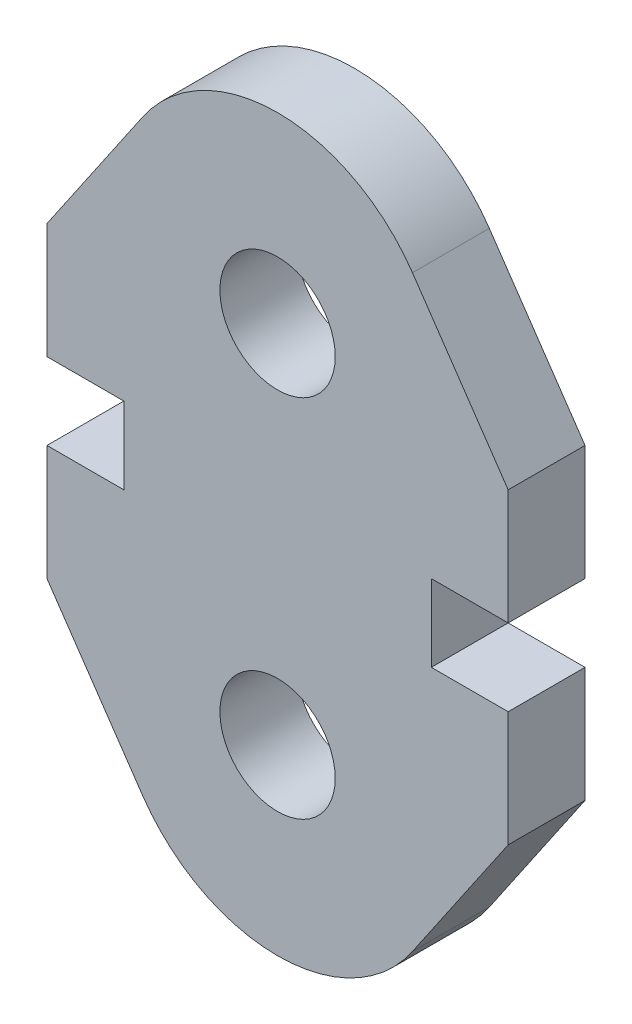
ISO-10303-21;
HEADER;
FILE_DESCRIPTION(('STEP AP214'),'2;1');
FILE_NAME('part.step','',(''),(''),'','','');
FILE_SCHEMA(('AUTOMOTIVE_DESIGN { 1 0 10303 214 1 1 1 1 }'));
ENDSEC;
DATA;
#1=APPLICATION_CONTEXT('core data for automotive mechanical design processes');
#2=APPLICATION_PROTOCOL_DEFINITION('international standard','automotive_design',2000,#1);
#3=PRODUCT_CONTEXT('',#1,'mechanical');
#4=PRODUCT('Part','Part','',(#3));
#5=PRODUCT_RELATED_PRODUCT_CATEGORY('part','',(#4));
#6=PRODUCT_DEFINITION_FORMATION('','',#4);
#7=PRODUCT_DEFINITION_CONTEXT('part definition',#1,'design');
#8=PRODUCT_DEFINITION('design','',#6,#7);
#9=PRODUCT_DEFINITION_SHAPE('','',#8);
#10=(LENGTH_UNIT() NAMED_UNIT(*) SI_UNIT(.MILLI.,.METRE.));
#11=(NAMED_UNIT(*) PLANE_ANGLE_UNIT() SI_UNIT($,.RADIAN.));
#12=(NAMED_UNIT(*) SI_UNIT($,.STERADIAN.) SOLID_ANGLE_UNIT());
#13=UNCERTAINTY_MEASURE_WITH_UNIT(LENGTH_MEASURE(1.E-05),#10,'distance_accuracy_value','');
#14=(GEOMETRIC_REPRESENTATION_CONTEXT(3) GLOBAL_UNCERTAINTY_ASSIGNED_CONTEXT((#13)) GLOBAL_UNIT_ASSIGNED_CONTEXT((#10,
#11,#12)) REPRESENTATION_CONTEXT('',''));
#15=CARTESIAN_POINT('',(0.,0.,0.));
#16=DIRECTION('',(0.,0.,1.));
#17=DIRECTION('',(1.,0.,0.));
#18=AXIS2_PLACEMENT_3D('',#15,#16,#17);
#19=CARTESIAN_POINT('',(0.,0.,1.));
#20=DIRECTION('',(0.,0.,1.));
#21=DIRECTION('',(1.,0.,0.));
#22=AXIS2_PLACEMENT_3D('',#19,#20,#21);
#23=PLANE('',#22);
#24=CARTESIAN_POINT('',(0.,5.75,1.));
#25=DIRECTION('',(0.,0.,1.));
#26=DIRECTION('',(1.,0.,0.));
#27=AXIS2_PLACEMENT_3D('',#24,#25,#26);
#28=CIRCLE('',#27,1.5);
#29=CARTESIAN_POINT('',(1.5,5.75,1.));
#30=VERTEX_POINT('',#29);
#31=EDGE_CURVE('E231',#30,#30,#28,.F.);
#32=ORIENTED_EDGE('',*,*,#31,.T.);
#33=EDGE_LOOP('',(#32));
#34=FACE_BOUND('',#33,.T.);
#35=DIRECTION('',(1.,0.,0.));
#36=VECTOR('',#35,1.);
#37=CARTESIAN_POINT('',(0.,0.,1.));
#38=LINE('',#37,#36);
#39=CARTESIAN_POINT('',(-4.,0.,1.));
#40=VERTEX_POINT('',#39);
#41=CARTESIAN_POINT('',(-6.,0.,1.));
#42=VERTEX_POINT('',#41);
#43=EDGE_CURVE('E161',#40,#42,#38,.F.);
#44=ORIENTED_EDGE('',*,*,#43,.T.);
#45=DIRECTION('',(0.,-1.,0.));
#46=VECTOR('',#45,1.);
#47=CARTESIAN_POINT('',(-6.,0.,1.));
#48=LINE('',#47,#46);
#49=CARTESIAN_POINT('',(-6.,-3.,1.));
#50=VERTEX_POINT('',#49);
#51=EDGE_CURVE('E159',#50,#42,#48,.F.);
#52=ORIENTED_EDGE('',*,*,#51,.F.);
#53=DIRECTION('',(0.563934312119362,-0.8258196483582,0.));
#54=VECTOR('',#53,1.);
#55=CARTESIAN_POINT('',(-5.48899265568138,-3.74831393714583,1.));
#56=LINE('',#55,#54);
#57=CARTESIAN_POINT('',(-3.50973350552235,-6.64672082650729,1.));
#58=VERTEX_POINT('',#57);
#59=EDGE_CURVE('E134',#58,#50,#56,.F.);
#60=ORIENTED_EDGE('',*,*,#59,.F.);
#61=CARTESIAN_POINT('',(0.,-4.25,1.));
#62=DIRECTION('',(0.,0.,1.));
#63=DIRECTION('',(1.,0.,0.));
#64=AXIS2_PLACEMENT_3D('',#61,#62,#63);
#65=CIRCLE('',#64,4.25);
#66=CARTESIAN_POINT('',(3.50973350552235,-6.64672082650729,1.));
#67=VERTEX_POINT('',#66);
#68=EDGE_CURVE('E127',#67,#58,#65,.F.);
#69=ORIENTED_EDGE('',*,*,#68,.F.);
#70=DIRECTION('',(-0.563934312119362,-0.8258196483582,0.));
#71=VECTOR('',#70,1.);
#72=CARTESIAN_POINT('',(5.48899265568138,-3.74831393714583,1.));
#73=LINE('',#72,#71);
#74=CARTESIAN_POINT('',(6.,-3.,1.));
#75=VERTEX_POINT('',#74);
#76=EDGE_CURVE('E131',#67,#75,#73,.F.);
#77=ORIENTED_EDGE('',*,*,#76,.T.);
#78=DIRECTION('',(0.,-1.,0.));
#79=VECTOR('',#78,1.);
#80=CARTESIAN_POINT('',(6.,0.,1.));
#81=LINE('',#80,#79);
#82=CARTESIAN_POINT('',(6.,0.,1.));
#83=VERTEX_POINT('',#82);
#84=EDGE_CURVE('E215',#75,#83,#81,.F.);
#85=ORIENTED_EDGE('',*,*,#84,.T.);
#86=DIRECTION('',(1.,0.,0.));
#87=VECTOR('',#86,1.);
#88=CARTESIAN_POINT('',(0.,0.,1.));
#89=LINE('',#88,#87);
#90=CARTESIAN_POINT('',(4.,0.,1.));
#91=VERTEX_POINT('',#90);
#92=EDGE_CURVE('E210',#83,#91,#89,.F.);
#93=ORIENTED_EDGE('',*,*,#92,.T.);
#94=DIRECTION('',(0.,-1.,0.));
#95=VECTOR('',#94,1.);
#96=CARTESIAN_POINT('',(4.,0.,1.));
#97=LINE('',#96,#95);
#98=CARTESIAN_POINT('',(4.,2.,1.));
#99=VERTEX_POINT('',#98);
#100=EDGE_CURVE('E205',#91,#99,#97,.F.);
#101=ORIENTED_EDGE('',*,*,#100,.T.);
#102=DIRECTION('',(1.,0.,0.));
#103=VECTOR('',#102,1.);
#104=CARTESIAN_POINT('',(0.,2.,1.));
#105=LINE('',#104,#103);
#106=CARTESIAN_POINT('',(6.,2.,1.));
#107=VERTEX_POINT('',#106);
#108=EDGE_CURVE('E197',#99,#107,#105,.T.);
#109=ORIENTED_EDGE('',*,*,#108,.T.);
#110=DIRECTION('',(0.,1.,0.));
#111=VECTOR('',#110,1.);
#112=CARTESIAN_POINT('',(6.,0.,1.));
#113=LINE('',#112,#111);
#114=CARTESIAN_POINT('',(6.,5.,1.));
#115=VERTEX_POINT('',#114);
#116=EDGE_CURVE('E195',#115,#107,#113,.F.);
#117=ORIENTED_EDGE('',*,*,#116,.F.);
#118=DIRECTION('',(-0.563934312119362,0.825819648358201,0.));
#119=VECTOR('',#118,1.);
#120=CARTESIAN_POINT('',(6.42040872634445,4.3843577539169,1.));
#121=LINE('',#120,#119);
#122=CARTESIAN_POINT('',(3.50973350552235,8.64672082650729,1.));
#123=VERTEX_POINT('',#122);
#124=EDGE_CURVE('E189',#123,#115,#121,.F.);
#125=ORIENTED_EDGE('',*,*,#124,.F.);
#126=CARTESIAN_POINT('',(0.,6.25,1.));
#127=DIRECTION('',(0.,0.,1.));
#128=DIRECTION('',(1.,0.,0.));
#129=AXIS2_PLACEMENT_3D('',#126,#127,#128);
#130=CIRCLE('',#129,4.25);
#131=CARTESIAN_POINT('',(-3.50973350552235,8.64672082650729,1.));
#132=VERTEX_POINT('',#131);
#133=EDGE_CURVE('E235',#132,#123,#130,.F.);
#134=ORIENTED_EDGE('',*,*,#133,.F.);
#135=DIRECTION('',(0.563934312119362,0.8258196483582,0.));
#136=VECTOR('',#135,1.);
#137=CARTESIAN_POINT('',(-6.42040872634445,4.3843577539169,1.));
#138=LINE('',#137,#136);
#139=CARTESIAN_POINT('',(-6.,5.,1.));
#140=VERTEX_POINT('',#139);
#141=EDGE_CURVE('E184',#132,#140,#138,.F.);
#142=ORIENTED_EDGE('',*,*,#141,.T.);
#143=DIRECTION('',(0.,1.,0.));
#144=VECTOR('',#143,1.);
#145=CARTESIAN_POINT('',(-6.,0.,1.));
#146=LINE('',#145,#144);
#147=CARTESIAN_POINT('',(-6.,2.,1.));
#148=VERTEX_POINT('',#147);
#149=EDGE_CURVE('E179',#140,#148,#146,.F.);
#150=ORIENTED_EDGE('',*,*,#149,.T.);
#151=DIRECTION('',(1.,0.,0.));
#152=VECTOR('',#151,1.);
#153=CARTESIAN_POINT('',(0.,2.,1.));
#154=LINE('',#153,#152);
#155=CARTESIAN_POINT('',(-4.,2.,1.));
#156=VERTEX_POINT('',#155);
#157=EDGE_CURVE('E171',#148,#156,#154,.T.);
#158=ORIENTED_EDGE('',*,*,#157,.T.);
#159=DIRECTION('',(0.,-1.,0.));
#160=VECTOR('',#159,1.);
#161=CARTESIAN_POINT('',(-4.,0.,1.));
#162=LINE('',#161,#160);
#163=EDGE_CURVE('E168',#40,#156,#162,.F.);
#164=ORIENTED_EDGE('',*,*,#163,.F.);
#165=EDGE_LOOP('',(#44,#52,#60,#69,#77,#85,#93,#101,#109,#117,#125,#134,#142,#150,#158,#164));
#166=FACE_BOUND('',#165,.T.);
#167=CARTESIAN_POINT('',(0.,-3.75,1.));
#168=DIRECTION('',(0.,0.,1.));
#169=DIRECTION('',(1.,0.,0.));
#170=AXIS2_PLACEMENT_3D('',#167,#168,#169);
#171=CIRCLE('',#170,1.5);
#172=CARTESIAN_POINT('',(1.5,-3.75,1.));
#173=VERTEX_POINT('',#172);
#174=EDGE_CURVE('E20',#173,#173,#171,.F.);
#175=ORIENTED_EDGE('',*,*,#174,.T.);
#176=EDGE_LOOP('',(#175));
#177=FACE_BOUND('',#176,.T.);
#178=ADVANCED_FACE('F17',(#34,#166,#177),#23,.T.);
#179=CARTESIAN_POINT('',(0.,-3.75,-1.));
#180=DIRECTION('',(0.,0.,1.));
#181=DIRECTION('',(1.,0.,0.));
#182=AXIS2_PLACEMENT_3D('',#179,#180,#181);
#183=CYLINDRICAL_SURFACE('',#182,1.5);
#184=CARTESIAN_POINT('',(0.,-3.75,-1.));
#185=DIRECTION('',(0.,0.,1.));
#186=DIRECTION('',(1.,0.,0.));
#187=AXIS2_PLACEMENT_3D('',#184,#185,#186);
#188=CIRCLE('',#187,1.5);
#189=CARTESIAN_POINT('',(1.5,-3.75,-1.));
#190=VERTEX_POINT('',#189);
#191=EDGE_CURVE('E228',#190,#190,#188,.F.);
#192=ORIENTED_EDGE('',*,*,#191,.T.);
#193=EDGE_LOOP('',(#192));
#194=FACE_BOUND('',#193,.T.);
#195=ORIENTED_EDGE('',*,*,#174,.F.);
#196=EDGE_LOOP('',(#195));
#197=FACE_BOUND('',#196,.T.);
#198=ADVANCED_FACE('F544',(#194,#197),#183,.F.);
#199=CARTESIAN_POINT('',(0.,-4.25,-1.));
#200=DIRECTION('',(0.,0.,1.));
#201=DIRECTION('',(1.,0.,0.));
#202=AXIS2_PLACEMENT_3D('',#199,#200,#201);
#203=CYLINDRICAL_SURFACE('',#202,4.25);
#204=CARTESIAN_POINT('',(0.,-4.25,-1.));
#205=DIRECTION('',(0.,0.,1.));
#206=DIRECTION('',(1.,0.,0.));
#207=AXIS2_PLACEMENT_3D('',#204,#205,#206);
#208=CIRCLE('',#207,4.25);
#209=CARTESIAN_POINT('',(-3.50973350552235,-6.64672082650729,-1.));
#210=VERTEX_POINT('',#209);
#211=CARTESIAN_POINT('',(3.50973350552235,-6.64672082650729,-1.));
#212=VERTEX_POINT('',#211);
#213=EDGE_CURVE('E149',#210,#212,#208,.T.);
#214=ORIENTED_EDGE('',*,*,#213,.T.);
#215=DIRECTION('',(0.,0.,1.));
#216=VECTOR('',#215,1.);
#217=CARTESIAN_POINT('',(3.50973350552235,-6.64672082650729,-1.));
#218=LINE('',#217,#216);
#219=EDGE_CURVE('E139',#212,#67,#218,.T.);
#220=ORIENTED_EDGE('',*,*,#219,.T.);
#221=ORIENTED_EDGE('',*,*,#68,.T.);
#222=DIRECTION('',(0.,0.,1.));
#223=VECTOR('',#222,1.);
#224=CARTESIAN_POINT('',(-3.50973350552235,-6.64672082650729,-1.));
#225=LINE('',#224,#223);
#226=EDGE_CURVE('E234',#210,#58,#225,.T.);
#227=ORIENTED_EDGE('',*,*,#226,.F.);
#228=EDGE_LOOP('',(#214,#220,#221,#227));
#229=FACE_BOUND('',#228,.T.);
#230=ADVANCED_FACE('F148',(#229),#203,.T.);
#231=CARTESIAN_POINT('',(5.48899265568138,-3.74831393714583,-1.));
#232=DIRECTION('',(-0.8258196483582,0.563934312119362,0.));
#233=DIRECTION('',(-0.563934312119362,-0.8258196483582,0.));
#234=AXIS2_PLACEMENT_3D('',#231,#232,#233);
#235=PLANE('',#234);
#236=ORIENTED_EDGE('',*,*,#219,.F.);
#237=DIRECTION('',(0.563934312119362,0.825819648358201,0.));
#238=VECTOR('',#237,1.);
#239=CARTESIAN_POINT('',(3.50973350552235,-6.64672082650729,-1.));
#240=LINE('',#239,#238);
#241=CARTESIAN_POINT('',(6.,-3.,-1.));
#242=VERTEX_POINT('',#241);
#243=EDGE_CURVE('E227',#212,#242,#240,.T.);
#244=ORIENTED_EDGE('',*,*,#243,.T.);
#245=DIRECTION('',(0.,0.,1.));
#246=VECTOR('',#245,1.);
#247=CARTESIAN_POINT('',(6.,-3.,-1.));
#248=LINE('',#247,#246);
#249=EDGE_CURVE('E145',#242,#75,#248,.T.);
#250=ORIENTED_EDGE('',*,*,#249,.T.);
#251=ORIENTED_EDGE('',*,*,#76,.F.);
#252=EDGE_LOOP('',(#236,#244,#250,#251));
#253=FACE_BOUND('',#252,.T.);
#254=ADVANCED_FACE('F142',(#253),#235,.F.);
#255=CARTESIAN_POINT('',(6.,0.,-1.));
#256=DIRECTION('',(-1.,0.,0.));
#257=DIRECTION('',(0.,-1.,0.));
#258=AXIS2_PLACEMENT_3D('',#255,#256,#257);
#259=PLANE('',#258);
#260=ORIENTED_EDGE('',*,*,#249,.F.);
#261=DIRECTION('',(0.,1.,0.));
#262=VECTOR('',#261,1.);
#263=CARTESIAN_POINT('',(6.,0.,-1.));
#264=LINE('',#263,#262);
#265=CARTESIAN_POINT('',(6.,0.,-1.));
#266=VERTEX_POINT('',#265);
#267=EDGE_CURVE('E279',#242,#266,#264,.T.);
#268=ORIENTED_EDGE('',*,*,#267,.T.);
#269=DIRECTION('',(0.,0.,1.));
#270=VECTOR('',#269,1.);
#271=CARTESIAN_POINT('',(6.,0.,-1.));
#272=LINE('',#271,#270);
#273=EDGE_CURVE('E212',#266,#83,#272,.T.);
#274=ORIENTED_EDGE('',*,*,#273,.T.);
#275=ORIENTED_EDGE('',*,*,#84,.F.);
#276=EDGE_LOOP('',(#260,#268,#274,#275));
#277=FACE_BOUND('',#276,.T.);
#278=ADVANCED_FACE('F519',(#277),#259,.F.);
#279=CARTESIAN_POINT('',(0.,0.,-1.));
#280=DIRECTION('',(0.,-1.,0.));
#281=DIRECTION('',(1.,0.,0.));
#282=AXIS2_PLACEMENT_3D('',#279,#280,#281);
#283=PLANE('',#282);
#284=ORIENTED_EDGE('',*,*,#273,.F.);
#285=DIRECTION('',(1.,0.,0.));
#286=VECTOR('',#285,1.);
#287=CARTESIAN_POINT('',(0.,0.,-1.));
#288=LINE('',#287,#286);
#289=CARTESIAN_POINT('',(4.,0.,-1.));
#290=VERTEX_POINT('',#289);
#291=EDGE_CURVE('E270',#266,#290,#288,.F.);
#292=ORIENTED_EDGE('',*,*,#291,.T.);
#293=DIRECTION('',(0.,0.,1.));
#294=VECTOR('',#293,1.);
#295=CARTESIAN_POINT('',(4.,0.,-1.));
#296=LINE('',#295,#294);
#297=EDGE_CURVE('E207',#290,#91,#296,.T.);
#298=ORIENTED_EDGE('',*,*,#297,.T.);
#299=ORIENTED_EDGE('',*,*,#92,.F.);
#300=EDGE_LOOP('',(#284,#292,#298,#299));
#301=FACE_BOUND('',#300,.T.);
#302=ADVANCED_FACE('F381',(#301),#283,.F.);
#303=CARTESIAN_POINT('',(4.,0.,-1.));
#304=DIRECTION('',(-1.,0.,0.));
#305=DIRECTION('',(0.,-1.,0.));
#306=AXIS2_PLACEMENT_3D('',#303,#304,#305);
#307=PLANE('',#306);
#308=ORIENTED_EDGE('',*,*,#297,.F.);
#309=DIRECTION('',(0.,1.,0.));
#310=VECTOR('',#309,1.);
#311=CARTESIAN_POINT('',(4.,0.,-1.));
#312=LINE('',#311,#310);
#313=CARTESIAN_POINT('',(4.,2.,-1.));
#314=VERTEX_POINT('',#313);
#315=EDGE_CURVE('E261',#290,#314,#312,.T.);
#316=ORIENTED_EDGE('',*,*,#315,.T.);
#317=DIRECTION('',(0.,0.,1.));
#318=VECTOR('',#317,1.);
#319=CARTESIAN_POINT('',(4.,2.,-1.));
#320=LINE('',#319,#318);
#321=EDGE_CURVE('E202',#314,#99,#320,.T.);
#322=ORIENTED_EDGE('',*,*,#321,.T.);
#323=ORIENTED_EDGE('',*,*,#100,.F.);
#324=EDGE_LOOP('',(#308,#316,#322,#323));
#325=FACE_BOUND('',#324,.T.);
#326=ADVANCED_FACE('F377',(#325),#307,.F.);
#327=CARTESIAN_POINT('',(0.,2.,-1.));
#328=DIRECTION('',(0.,1.,0.));
#329=DIRECTION('',(0.,0.,1.));
#330=AXIS2_PLACEMENT_3D('',#327,#328,#329);
#331=PLANE('',#330);
#332=ORIENTED_EDGE('',*,*,#321,.F.);
#333=DIRECTION('',(1.,0.,0.));
#334=VECTOR('',#333,1.);
#335=CARTESIAN_POINT('',(0.,2.,-1.));
#336=LINE('',#335,#334);
#337=CARTESIAN_POINT('',(6.,2.,-1.));
#338=VERTEX_POINT('',#337);
#339=EDGE_CURVE('E253',#314,#338,#336,.T.);
#340=ORIENTED_EDGE('',*,*,#339,.T.);
#341=DIRECTION('',(0.,0.,1.));
#342=VECTOR('',#341,1.);
#343=CARTESIAN_POINT('',(6.,2.,-1.));
#344=LINE('',#343,#342);
#345=EDGE_CURVE('E192',#107,#338,#344,.F.);
#346=ORIENTED_EDGE('',*,*,#345,.F.);
#347=ORIENTED_EDGE('',*,*,#108,.F.);
#348=EDGE_LOOP('',(#332,#340,#346,#347));
#349=FACE_BOUND('',#348,.T.);
#350=ADVANCED_FACE('F373',(#349),#331,.F.);
#351=CARTESIAN_POINT('',(6.,0.,-1.));
#352=DIRECTION('',(1.,0.,0.));
#353=DIRECTION('',(0.,1.,0.));
#354=AXIS2_PLACEMENT_3D('',#351,#352,#353);
#355=PLANE('',#354);
#356=DIRECTION('',(0.,1.,0.));
#357=VECTOR('',#356,1.);
#358=CARTESIAN_POINT('',(6.,0.,-1.));
#359=LINE('',#358,#357);
#360=CARTESIAN_POINT('',(6.,5.,-1.));
#361=VERTEX_POINT('',#360);
#362=EDGE_CURVE('E250',#338,#361,#359,.T.);
#363=ORIENTED_EDGE('',*,*,#362,.T.);
#364=DIRECTION('',(0.,0.,1.));
#365=VECTOR('',#364,1.);
#366=CARTESIAN_POINT('',(6.,5.,-1.));
#367=LINE('',#366,#365);
#368=EDGE_CURVE('E191',#115,#361,#367,.F.);
#369=ORIENTED_EDGE('',*,*,#368,.F.);
#370=ORIENTED_EDGE('',*,*,#116,.T.);
#371=ORIENTED_EDGE('',*,*,#345,.T.);
#372=EDGE_LOOP('',(#363,#369,#370,#371));
#373=FACE_BOUND('',#372,.T.);
#374=ADVANCED_FACE('F368',(#373),#355,.T.);
#375=CARTESIAN_POINT('',(6.42040872634445,4.3843577539169,-1.));
#376=DIRECTION('',(0.825819648358201,0.563934312119362,0.));
#377=DIRECTION('',(-0.563934312119362,0.825819648358201,0.));
#378=AXIS2_PLACEMENT_3D('',#375,#376,#377);
#379=PLANE('',#378);
#380=DIRECTION('',(-0.563934312119362,0.825819648358201,0.));
#381=VECTOR('',#380,1.);
#382=CARTESIAN_POINT('',(6.,5.,-1.));
#383=LINE('',#382,#381);
#384=CARTESIAN_POINT('',(3.50973350552235,8.64672082650729,-1.));
#385=VERTEX_POINT('',#384);
#386=EDGE_CURVE('E225',#361,#385,#383,.T.);
#387=ORIENTED_EDGE('',*,*,#386,.T.);
#388=DIRECTION('',(0.,0.,1.));
#389=VECTOR('',#388,1.);
#390=CARTESIAN_POINT('',(3.50973350552235,8.64672082650729,-1.));
#391=LINE('',#390,#389);
#392=EDGE_CURVE('E236',#123,#385,#391,.F.);
#393=ORIENTED_EDGE('',*,*,#392,.F.);
#394=ORIENTED_EDGE('',*,*,#124,.T.);
#395=ORIENTED_EDGE('',*,*,#368,.T.);
#396=EDGE_LOOP('',(#387,#393,#394,#395));
#397=FACE_BOUND('',#396,.T.);
#398=ADVANCED_FACE('F364',(#397),#379,.T.);
#399=CARTESIAN_POINT('',(0.,6.25,-1.));
#400=DIRECTION('',(0.,0.,1.));
#401=DIRECTION('',(1.,0.,0.));
#402=AXIS2_PLACEMENT_3D('',#399,#400,#401);
#403=CYLINDRICAL_SURFACE('',#402,4.25);
#404=CARTESIAN_POINT('',(0.,6.25,-1.));
#405=DIRECTION('',(0.,0.,1.));
#406=DIRECTION('',(1.,0.,0.));
#407=AXIS2_PLACEMENT_3D('',#404,#405,#406);
#408=CIRCLE('',#407,4.25);
#409=CARTESIAN_POINT('',(-3.50973350552235,8.64672082650729,-1.));
#410=VERTEX_POINT('',#409);
#411=EDGE_CURVE('E221',#385,#410,#408,.T.);
#412=ORIENTED_EDGE('',*,*,#411,.T.);
#413=DIRECTION('',(0.,0.,1.));
#414=VECTOR('',#413,1.);
#415=CARTESIAN_POINT('',(-3.50973350552235,8.64672082650729,-1.));
#416=LINE('',#415,#414);
#417=EDGE_CURVE('E186',#410,#132,#416,.T.);
#418=ORIENTED_EDGE('',*,*,#417,.T.);
#419=ORIENTED_EDGE('',*,*,#133,.T.);
#420=ORIENTED_EDGE('',*,*,#392,.T.);
#421=EDGE_LOOP('',(#412,#418,#419,#420));
#422=FACE_BOUND('',#421,.T.);
#423=ADVANCED_FACE('F344',(#422),#403,.T.);
#424=CARTESIAN_POINT('',(-6.42040872634445,4.3843577539169,-1.));
#425=DIRECTION('',(0.8258196483582,-0.563934312119362,0.));
#426=DIRECTION('',(0.563934312119362,0.8258196483582,0.));
#427=AXIS2_PLACEMENT_3D('',#424,#425,#426);
#428=PLANE('',#427);
#429=ORIENTED_EDGE('',*,*,#417,.F.);
#430=DIRECTION('',(-0.563934312119362,-0.825819648358201,0.));
#431=VECTOR('',#430,1.);
#432=CARTESIAN_POINT('',(-3.50973350552235,8.64672082650729,-1.));
#433=LINE('',#432,#431);
#434=CARTESIAN_POINT('',(-6.,5.,-1.));
#435=VERTEX_POINT('',#434);
#436=EDGE_CURVE('E224',#410,#435,#433,.T.);
#437=ORIENTED_EDGE('',*,*,#436,.T.);
#438=DIRECTION('',(0.,0.,1.));
#439=VECTOR('',#438,1.);
#440=CARTESIAN_POINT('',(-6.,5.,-1.));
#441=LINE('',#440,#439);
#442=EDGE_CURVE('E181',#435,#140,#441,.T.);
#443=ORIENTED_EDGE('',*,*,#442,.T.);
#444=ORIENTED_EDGE('',*,*,#141,.F.);
#445=EDGE_LOOP('',(#429,#437,#443,#444));
#446=FACE_BOUND('',#445,.T.);
#447=ADVANCED_FACE('F350',(#446),#428,.F.);
#448=CARTESIAN_POINT('',(-6.,0.,-1.));
#449=DIRECTION('',(1.,0.,0.));
#450=DIRECTION('',(0.,1.,0.));
#451=AXIS2_PLACEMENT_3D('',#448,#449,#450);
#452=PLANE('',#451);
#453=ORIENTED_EDGE('',*,*,#442,.F.);
#454=DIRECTION('',(0.,1.,0.));
#455=VECTOR('',#454,1.);
#456=CARTESIAN_POINT('',(-6.,0.,-1.));
#457=LINE('',#456,#455);
#458=CARTESIAN_POINT('',(-6.,2.,-1.));
#459=VERTEX_POINT('',#458);
#460=EDGE_CURVE('E330',#435,#459,#457,.F.);
#461=ORIENTED_EDGE('',*,*,#460,.T.);
#462=DIRECTION('',(0.,0.,1.));
#463=VECTOR('',#462,1.);
#464=CARTESIAN_POINT('',(-6.,2.,-1.));
#465=LINE('',#464,#463);
#466=EDGE_CURVE('E176',#459,#148,#465,.T.);
#467=ORIENTED_EDGE('',*,*,#466,.T.);
#468=ORIENTED_EDGE('',*,*,#149,.F.);
#469=EDGE_LOOP('',(#453,#461,#467,#468));
#470=FACE_BOUND('',#469,.T.);
#471=ADVANCED_FACE('F452',(#470),#452,.F.);
#472=CARTESIAN_POINT('',(0.,2.,-1.));
#473=DIRECTION('',(0.,1.,0.));
#474=DIRECTION('',(0.,0.,1.));
#475=AXIS2_PLACEMENT_3D('',#472,#473,#474);
#476=PLANE('',#475);
#477=ORIENTED_EDGE('',*,*,#466,.F.);
#478=DIRECTION('',(1.,0.,0.));
#479=VECTOR('',#478,1.);
#480=CARTESIAN_POINT('',(0.,2.,-1.));
#481=LINE('',#480,#479);
#482=CARTESIAN_POINT('',(-4.,2.,-1.));
#483=VERTEX_POINT('',#482);
#484=EDGE_CURVE('E322',#459,#483,#481,.T.);
#485=ORIENTED_EDGE('',*,*,#484,.T.);
#486=DIRECTION('',(0.,0.,1.));
#487=VECTOR('',#486,1.);
#488=CARTESIAN_POINT('',(-4.,2.,-1.));
#489=LINE('',#488,#487);
#490=EDGE_CURVE('E170',#156,#483,#489,.F.);
#491=ORIENTED_EDGE('',*,*,#490,.F.);
#492=ORIENTED_EDGE('',*,*,#157,.F.);
#493=EDGE_LOOP('',(#477,#485,#491,#492));
#494=FACE_BOUND('',#493,.T.);
#495=ADVANCED_FACE('F442',(#494),#476,.F.);
#496=CARTESIAN_POINT('',(-4.,0.,-1.));
#497=DIRECTION('',(-1.,0.,0.));
#498=DIRECTION('',(0.,-1.,0.));
#499=AXIS2_PLACEMENT_3D('',#496,#497,#498);
#500=PLANE('',#499);
#501=DIRECTION('',(0.,1.,0.));
#502=VECTOR('',#501,1.);
#503=CARTESIAN_POINT('',(-4.,0.,-1.));
#504=LINE('',#503,#502);
#505=CARTESIAN_POINT('',(-4.,0.,-1.));
#506=VERTEX_POINT('',#505);
#507=EDGE_CURVE('E313',#483,#506,#504,.F.);
#508=ORIENTED_EDGE('',*,*,#507,.T.);
#509=DIRECTION('',(0.,0.,1.));
#510=VECTOR('',#509,1.);
#511=CARTESIAN_POINT('',(-4.,0.,-1.));
#512=LINE('',#511,#510);
#513=EDGE_CURVE('E165',#506,#40,#512,.T.);
#514=ORIENTED_EDGE('',*,*,#513,.T.);
#515=ORIENTED_EDGE('',*,*,#163,.T.);
#516=ORIENTED_EDGE('',*,*,#490,.T.);
#517=EDGE_LOOP('',(#508,#514,#515,#516));
#518=FACE_BOUND('',#517,.T.);
#519=ADVANCED_FACE('F432',(#518),#500,.T.);
#520=CARTESIAN_POINT('',(0.,0.,-1.));
#521=DIRECTION('',(0.,-1.,0.));
#522=DIRECTION('',(1.,0.,0.));
#523=AXIS2_PLACEMENT_3D('',#520,#521,#522);
#524=PLANE('',#523);
#525=ORIENTED_EDGE('',*,*,#513,.F.);
#526=DIRECTION('',(1.,0.,0.));
#527=VECTOR('',#526,1.);
#528=CARTESIAN_POINT('',(0.,0.,-1.));
#529=LINE('',#528,#527);
#530=CARTESIAN_POINT('',(-6.,0.,-1.));
#531=VERTEX_POINT('',#530);
#532=EDGE_CURVE('E305',#506,#531,#529,.F.);
#533=ORIENTED_EDGE('',*,*,#532,.T.);
#534=DIRECTION('',(0.,0.,1.));
#535=VECTOR('',#534,1.);
#536=CARTESIAN_POINT('',(-6.,0.,-1.));
#537=LINE('',#536,#535);
#538=EDGE_CURVE('E156',#42,#531,#537,.F.);
#539=ORIENTED_EDGE('',*,*,#538,.F.);
#540=ORIENTED_EDGE('',*,*,#43,.F.);
#541=EDGE_LOOP('',(#525,#533,#539,#540));
#542=FACE_BOUND('',#541,.T.);
#543=ADVANCED_FACE('F394',(#542),#524,.F.);
#544=CARTESIAN_POINT('',(-6.,0.,-1.));
#545=DIRECTION('',(-1.,0.,0.));
#546=DIRECTION('',(0.,-1.,0.));
#547=AXIS2_PLACEMENT_3D('',#544,#545,#546);
#548=PLANE('',#547);
#549=DIRECTION('',(0.,1.,0.));
#550=VECTOR('',#549,1.);
#551=CARTESIAN_POINT('',(-6.,0.,-1.));
#552=LINE('',#551,#550);
#553=CARTESIAN_POINT('',(-6.,-3.,-1.));
#554=VERTEX_POINT('',#553);
#555=EDGE_CURVE('E302',#531,#554,#552,.F.);
#556=ORIENTED_EDGE('',*,*,#555,.T.);
#557=DIRECTION('',(0.,0.,1.));
#558=VECTOR('',#557,1.);
#559=CARTESIAN_POINT('',(-6.,-3.,-1.));
#560=LINE('',#559,#558);
#561=EDGE_CURVE('E35',#50,#554,#560,.F.);
#562=ORIENTED_EDGE('',*,*,#561,.F.);
#563=ORIENTED_EDGE('',*,*,#51,.T.);
#564=ORIENTED_EDGE('',*,*,#538,.T.);
#565=EDGE_LOOP('',(#556,#562,#563,#564));
#566=FACE_BOUND('',#565,.T.);
#567=ADVANCED_FACE('F385',(#566),#548,.T.);
#568=CARTESIAN_POINT('',(-5.48899265568138,-3.74831393714583,-1.));
#569=DIRECTION('',(-0.8258196483582,-0.563934312119362,0.));
#570=DIRECTION('',(0.563934312119362,-0.8258196483582,0.));
#571=AXIS2_PLACEMENT_3D('',#568,#569,#570);
#572=PLANE('',#571);
#573=DIRECTION('',(0.563934312119362,-0.825819648358201,0.));
#574=VECTOR('',#573,1.);
#575=CARTESIAN_POINT('',(-6.,-3.,-1.));
#576=LINE('',#575,#574);
#577=EDGE_CURVE('E26',#554,#210,#576,.T.);
#578=ORIENTED_EDGE('',*,*,#577,.T.);
#579=ORIENTED_EDGE('',*,*,#226,.T.);
#580=ORIENTED_EDGE('',*,*,#59,.T.);
#581=ORIENTED_EDGE('',*,*,#561,.T.);
#582=EDGE_LOOP('',(#578,#579,#580,#581));
#583=FACE_BOUND('',#582,.T.);
#584=ADVANCED_FACE('F382',(#583),#572,.T.);
#585=CARTESIAN_POINT('',(0.,5.75,-1.));
#586=DIRECTION('',(0.,0.,1.));
#587=DIRECTION('',(1.,0.,0.));
#588=AXIS2_PLACEMENT_3D('',#585,#586,#587);
#589=CYLINDRICAL_SURFACE('',#588,1.5);
#590=ORIENTED_EDGE('',*,*,#31,.F.);
#591=EDGE_LOOP('',(#590));
#592=FACE_BOUND('',#591,.T.);
#593=CARTESIAN_POINT('',(0.,5.75,-1.));
#594=DIRECTION('',(0.,0.,1.));
#595=DIRECTION('',(1.,0.,0.));
#596=AXIS2_PLACEMENT_3D('',#593,#594,#595);
#597=CIRCLE('',#596,1.5);
#598=CARTESIAN_POINT('',(1.5,5.75,-1.));
#599=VERTEX_POINT('',#598);
#600=EDGE_CURVE('E11',#599,#599,#597,.F.);
#601=ORIENTED_EDGE('',*,*,#600,.T.);
#602=EDGE_LOOP('',(#601));
#603=FACE_BOUND('',#602,.T.);
#604=ADVANCED_FACE('F384',(#592,#603),#589,.F.);
#605=CARTESIAN_POINT('',(0.,0.,-1.));
#606=DIRECTION('',(0.,0.,1.));
#607=DIRECTION('',(1.,0.,0.));
#608=AXIS2_PLACEMENT_3D('',#605,#606,#607);
#609=PLANE('',#608);
#610=ORIENTED_EDGE('',*,*,#600,.F.);
#611=EDGE_LOOP('',(#610));
#612=FACE_BOUND('',#611,.T.);
#613=ORIENTED_EDGE('',*,*,#555,.F.);
#614=ORIENTED_EDGE('',*,*,#532,.F.);
#615=ORIENTED_EDGE('',*,*,#507,.F.);
#616=ORIENTED_EDGE('',*,*,#484,.F.);
#617=ORIENTED_EDGE('',*,*,#460,.F.);
#618=ORIENTED_EDGE('',*,*,#436,.F.);
#619=ORIENTED_EDGE('',*,*,#411,.F.);
#620=ORIENTED_EDGE('',*,*,#386,.F.);
#621=ORIENTED_EDGE('',*,*,#362,.F.);
#622=ORIENTED_EDGE('',*,*,#339,.F.);
#623=ORIENTED_EDGE('',*,*,#315,.F.);
#624=ORIENTED_EDGE('',*,*,#291,.F.);
#625=ORIENTED_EDGE('',*,*,#267,.F.);
#626=ORIENTED_EDGE('',*,*,#243,.F.);
#627=ORIENTED_EDGE('',*,*,#213,.F.);
#628=ORIENTED_EDGE('',*,*,#577,.F.);
#629=EDGE_LOOP('',(#613,#614,#615,#616,#617,#618,#619,#620,#621,#622,#623,#624,#625,#626,#627,#628));
#630=FACE_BOUND('',#629,.T.);
#631=ORIENTED_EDGE('',*,*,#191,.F.);
#632=EDGE_LOOP('',(#631));
#633=FACE_BOUND('',#632,.T.);
#634=ADVANCED_FACE('F354',(#612,#630,#633),#609,.F.);
#635=CLOSED_SHELL('',(#178,#198,#230,#254,#278,#302,#326,#350,#374,#398,#423,#447,#471,#495,
#519,#543,#567,#584,#604,#634));
#636=MANIFOLD_SOLID_BREP('B1',#635);
#637=ADVANCED_BREP_SHAPE_REPRESENTATION('',(#18,#636),#14);
#638=SHAPE_DEFINITION_REPRESENTATION(#9,#637);
ENDSEC;
END-ISO-10303-21;
